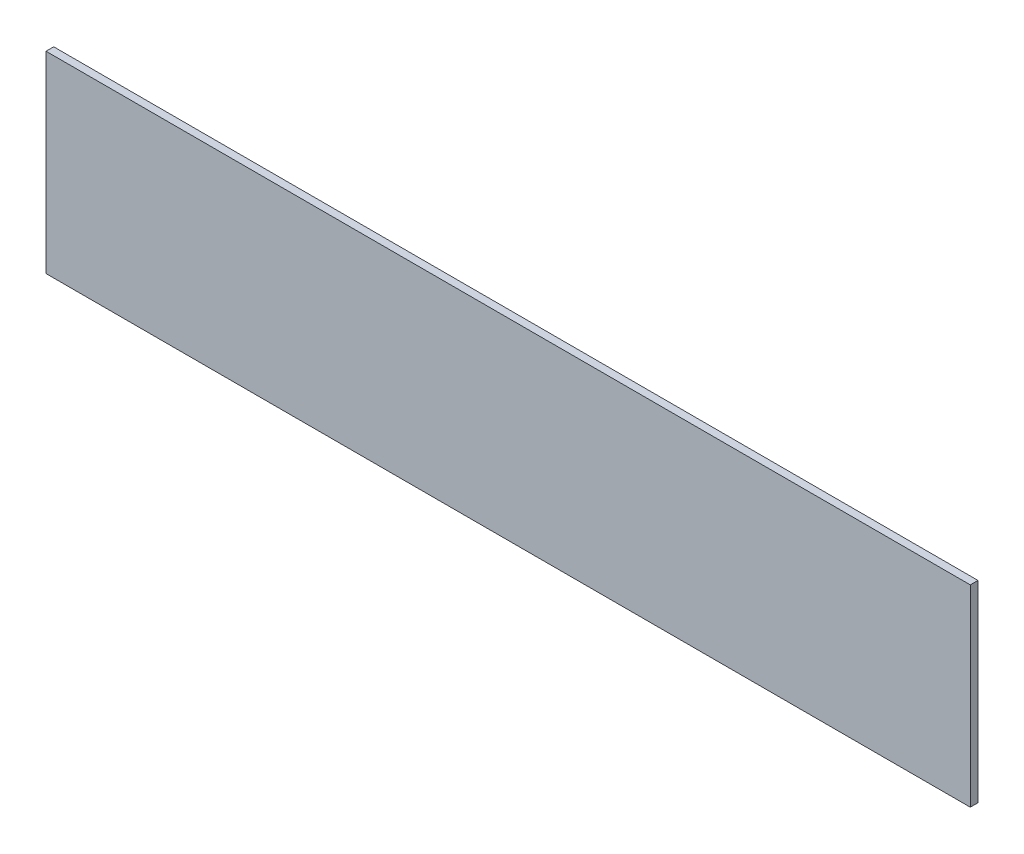
ISO-10303-21;
HEADER;
FILE_DESCRIPTION(('STEP AP214'),'2;1');
FILE_NAME('part.step','',(''),(''),'','','');
FILE_SCHEMA(('AUTOMOTIVE_DESIGN { 1 0 10303 214 1 1 1 1 }'));
ENDSEC;
DATA;
#1=APPLICATION_CONTEXT('core data for automotive mechanical design processes');
#2=APPLICATION_PROTOCOL_DEFINITION('international standard','automotive_design',2000,#1);
#3=PRODUCT_CONTEXT('',#1,'mechanical');
#4=PRODUCT('Part','Part','',(#3));
#5=PRODUCT_RELATED_PRODUCT_CATEGORY('part','',(#4));
#6=PRODUCT_DEFINITION_FORMATION('','',#4);
#7=PRODUCT_DEFINITION_CONTEXT('part definition',#1,'design');
#8=PRODUCT_DEFINITION('design','',#6,#7);
#9=PRODUCT_DEFINITION_SHAPE('','',#8);
#10=(LENGTH_UNIT() NAMED_UNIT(*) SI_UNIT(.MILLI.,.METRE.));
#11=(NAMED_UNIT(*) PLANE_ANGLE_UNIT() SI_UNIT($,.RADIAN.));
#12=(NAMED_UNIT(*) SI_UNIT($,.STERADIAN.) SOLID_ANGLE_UNIT());
#13=UNCERTAINTY_MEASURE_WITH_UNIT(LENGTH_MEASURE(1.E-05),#10,'distance_accuracy_value','');
#14=(GEOMETRIC_REPRESENTATION_CONTEXT(3) GLOBAL_UNCERTAINTY_ASSIGNED_CONTEXT((#13)) GLOBAL_UNIT_ASSIGNED_CONTEXT((#10,
#11,#12)) REPRESENTATION_CONTEXT('',''));
#15=CARTESIAN_POINT('',(0.,0.,0.));
#16=DIRECTION('',(0.,0.,1.));
#17=DIRECTION('',(1.,0.,0.));
#18=AXIS2_PLACEMENT_3D('',#15,#16,#17);
#19=CARTESIAN_POINT('',(0.,0.,-20.));
#20=DIRECTION('',(-1.,0.,0.));
#21=DIRECTION('',(0.,-1.,0.));
#22=AXIS2_PLACEMENT_3D('',#19,#20,#21);
#23=PLANE('',#22);
#24=DIRECTION('',(0.,-1.,0.));
#25=VECTOR('',#24,1.);
#26=CARTESIAN_POINT('',(0.,0.,0.));
#27=LINE('',#26,#25);
#28=CARTESIAN_POINT('',(0.,0.,0.));
#29=VERTEX_POINT('',#28);
#30=CARTESIAN_POINT('',(0.,-500.,0.));
#31=VERTEX_POINT('',#30);
#32=EDGE_CURVE('E102',#29,#31,#27,.T.);
#33=ORIENTED_EDGE('',*,*,#32,.F.);
#34=DIRECTION('',(0.,0.,1.));
#35=VECTOR('',#34,1.);
#36=CARTESIAN_POINT('',(0.,0.,-20.));
#37=LINE('',#36,#35);
#38=CARTESIAN_POINT('',(0.,0.,-20.));
#39=VERTEX_POINT('',#38);
#40=EDGE_CURVE('E11',#39,#29,#37,.T.);
#41=ORIENTED_EDGE('',*,*,#40,.F.);
#42=DIRECTION('',(0.,-1.,0.));
#43=VECTOR('',#42,1.);
#44=CARTESIAN_POINT('',(0.,0.,-20.));
#45=LINE('',#44,#43);
#46=CARTESIAN_POINT('',(0.,-500.,-20.));
#47=VERTEX_POINT('',#46);
#48=EDGE_CURVE('E96',#39,#47,#45,.T.);
#49=ORIENTED_EDGE('',*,*,#48,.T.);
#50=DIRECTION('',(0.,0.,1.));
#51=VECTOR('',#50,1.);
#52=CARTESIAN_POINT('',(0.,-500.,-20.));
#53=LINE('',#52,#51);
#54=EDGE_CURVE('E41',#47,#31,#53,.T.);
#55=ORIENTED_EDGE('',*,*,#54,.T.);
#56=EDGE_LOOP('',(#33,#41,#49,#55));
#57=FACE_BOUND('',#56,.T.);
#58=ADVANCED_FACE('F38',(#57),#23,.T.);
#59=CARTESIAN_POINT('',(0.,0.,-20.));
#60=DIRECTION('',(0.,1.,0.));
#61=DIRECTION('',(0.,0.,1.));
#62=AXIS2_PLACEMENT_3D('',#59,#60,#61);
#63=PLANE('',#62);
#64=DIRECTION('',(-1.,0.,0.));
#65=VECTOR('',#64,1.);
#66=CARTESIAN_POINT('',(0.,0.,0.));
#67=LINE('',#66,#65);
#68=CARTESIAN_POINT('',(2400.,0.,0.));
#69=VERTEX_POINT('',#68);
#70=EDGE_CURVE('E98',#69,#29,#67,.T.);
#71=ORIENTED_EDGE('',*,*,#70,.F.);
#72=DIRECTION('',(0.,0.,1.));
#73=VECTOR('',#72,1.);
#74=CARTESIAN_POINT('',(2400.,0.,-20.));
#75=LINE('',#74,#73);
#76=CARTESIAN_POINT('',(2400.,0.,-20.));
#77=VERTEX_POINT('',#76);
#78=EDGE_CURVE('E47',#77,#69,#75,.T.);
#79=ORIENTED_EDGE('',*,*,#78,.F.);
#80=DIRECTION('',(-1.,0.,0.));
#81=VECTOR('',#80,1.);
#82=CARTESIAN_POINT('',(0.,0.,-20.));
#83=LINE('',#82,#81);
#84=EDGE_CURVE('E93',#77,#39,#83,.T.);
#85=ORIENTED_EDGE('',*,*,#84,.T.);
#86=ORIENTED_EDGE('',*,*,#40,.T.);
#87=EDGE_LOOP('',(#71,#79,#85,#86));
#88=FACE_BOUND('',#87,.T.);
#89=ADVANCED_FACE('F112',(#88),#63,.T.);
#90=CARTESIAN_POINT('',(2400.,0.,-20.));
#91=DIRECTION('',(1.,0.,0.));
#92=DIRECTION('',(0.,0.,-1.));
#93=AXIS2_PLACEMENT_3D('',#90,#91,#92);
#94=PLANE('',#93);
#95=DIRECTION('',(0.,1.,0.));
#96=VECTOR('',#95,1.);
#97=CARTESIAN_POINT('',(2400.,0.,0.));
#98=LINE('',#97,#96);
#99=CARTESIAN_POINT('',(2400.,-500.,0.));
#100=VERTEX_POINT('',#99);
#101=EDGE_CURVE('E88',#100,#69,#98,.T.);
#102=ORIENTED_EDGE('',*,*,#101,.F.);
#103=DIRECTION('',(0.,0.,1.));
#104=VECTOR('',#103,1.);
#105=CARTESIAN_POINT('',(2400.,-500.,-20.));
#106=LINE('',#105,#104);
#107=CARTESIAN_POINT('',(2400.,-500.,-20.));
#108=VERTEX_POINT('',#107);
#109=EDGE_CURVE('E83',#108,#100,#106,.T.);
#110=ORIENTED_EDGE('',*,*,#109,.F.);
#111=DIRECTION('',(0.,1.,0.));
#112=VECTOR('',#111,1.);
#113=CARTESIAN_POINT('',(2400.,0.,-20.));
#114=LINE('',#113,#112);
#115=EDGE_CURVE('E86',#108,#77,#114,.T.);
#116=ORIENTED_EDGE('',*,*,#115,.T.);
#117=ORIENTED_EDGE('',*,*,#78,.T.);
#118=EDGE_LOOP('',(#102,#110,#116,#117));
#119=FACE_BOUND('',#118,.T.);
#120=ADVANCED_FACE('F85',(#119),#94,.T.);
#121=CARTESIAN_POINT('',(0.,-500.,-20.));
#122=DIRECTION('',(0.,-1.,0.));
#123=DIRECTION('',(0.,0.,-1.));
#124=AXIS2_PLACEMENT_3D('',#121,#122,#123);
#125=PLANE('',#124);
#126=DIRECTION('',(1.,0.,0.));
#127=VECTOR('',#126,1.);
#128=CARTESIAN_POINT('',(0.,-500.,0.));
#129=LINE('',#128,#127);
#130=EDGE_CURVE('E105',#31,#100,#129,.T.);
#131=ORIENTED_EDGE('',*,*,#130,.F.);
#132=ORIENTED_EDGE('',*,*,#54,.F.);
#133=DIRECTION('',(1.,0.,0.));
#134=VECTOR('',#133,1.);
#135=CARTESIAN_POINT('',(0.,-500.,-20.));
#136=LINE('',#135,#134);
#137=EDGE_CURVE('E92',#47,#108,#136,.T.);
#138=ORIENTED_EDGE('',*,*,#137,.T.);
#139=ORIENTED_EDGE('',*,*,#109,.T.);
#140=EDGE_LOOP('',(#131,#132,#138,#139));
#141=FACE_BOUND('',#140,.T.);
#142=ADVANCED_FACE('F95',(#141),#125,.T.);
#143=CARTESIAN_POINT('',(0.,0.,-20.));
#144=DIRECTION('',(0.,0.,1.));
#145=DIRECTION('',(1.,0.,0.));
#146=AXIS2_PLACEMENT_3D('',#143,#144,#145);
#147=PLANE('',#146);
#148=ORIENTED_EDGE('',*,*,#48,.F.);
#149=ORIENTED_EDGE('',*,*,#84,.F.);
#150=ORIENTED_EDGE('',*,*,#115,.F.);
#151=ORIENTED_EDGE('',*,*,#137,.F.);
#152=EDGE_LOOP('',(#148,#149,#150,#151));
#153=FACE_BOUND('',#152,.T.);
#154=ADVANCED_FACE('F91',(#153),#147,.F.);
#155=CARTESIAN_POINT('',(0.,0.,0.));
#156=DIRECTION('',(0.,0.,1.));
#157=DIRECTION('',(1.,0.,0.));
#158=AXIS2_PLACEMENT_3D('',#155,#156,#157);
#159=PLANE('',#158);
#160=ORIENTED_EDGE('',*,*,#32,.T.);
#161=ORIENTED_EDGE('',*,*,#130,.T.);
#162=ORIENTED_EDGE('',*,*,#101,.T.);
#163=ORIENTED_EDGE('',*,*,#70,.T.);
#164=EDGE_LOOP('',(#160,#161,#162,#163));
#165=FACE_BOUND('',#164,.T.);
#166=ADVANCED_FACE('F111',(#165),#159,.T.);
#167=CLOSED_SHELL('',(#58,#89,#120,#142,#154,#166));
#168=MANIFOLD_SOLID_BREP('B2',#167);
#169=ADVANCED_BREP_SHAPE_REPRESENTATION('',(#18,#168),#14);
#170=SHAPE_DEFINITION_REPRESENTATION(#9,#169);
ENDSEC;
END-ISO-10303-21;
